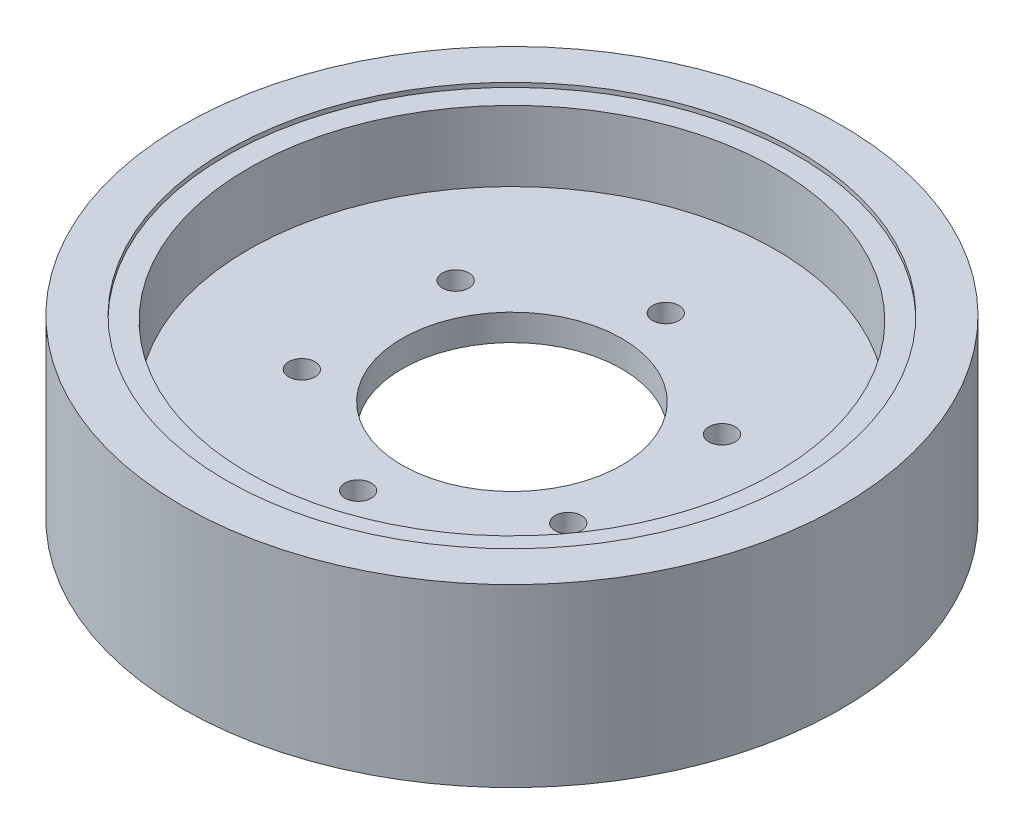
ISO-10303-21;
HEADER;
FILE_DESCRIPTION(('STEP AP214'),'2;1');
FILE_NAME('part.step','',(''),(''),'','','');
FILE_SCHEMA(('AUTOMOTIVE_DESIGN { 1 0 10303 214 1 1 1 1 }'));
ENDSEC;
DATA;
#1=APPLICATION_CONTEXT('core data for automotive mechanical design processes');
#2=APPLICATION_PROTOCOL_DEFINITION('international standard','automotive_design',2000,#1);
#3=PRODUCT_CONTEXT('',#1,'mechanical');
#4=PRODUCT('Part','Part','',(#3));
#5=PRODUCT_RELATED_PRODUCT_CATEGORY('part','',(#4));
#6=PRODUCT_DEFINITION_FORMATION('','',#4);
#7=PRODUCT_DEFINITION_CONTEXT('part definition',#1,'design');
#8=PRODUCT_DEFINITION('design','',#6,#7);
#9=PRODUCT_DEFINITION_SHAPE('','',#8);
#10=(LENGTH_UNIT() NAMED_UNIT(*) SI_UNIT(.MILLI.,.METRE.));
#11=(NAMED_UNIT(*) PLANE_ANGLE_UNIT() SI_UNIT($,.RADIAN.));
#12=(NAMED_UNIT(*) SI_UNIT($,.STERADIAN.) SOLID_ANGLE_UNIT());
#13=UNCERTAINTY_MEASURE_WITH_UNIT(LENGTH_MEASURE(1.E-05),#10,'distance_accuracy_value','');
#14=(GEOMETRIC_REPRESENTATION_CONTEXT(3) GLOBAL_UNCERTAINTY_ASSIGNED_CONTEXT((#13)) GLOBAL_UNIT_ASSIGNED_CONTEXT((#10,
#11,#12)) REPRESENTATION_CONTEXT('',''));
#15=CARTESIAN_POINT('',(0.,0.,0.));
#16=DIRECTION('',(0.,0.,1.));
#17=DIRECTION('',(1.,0.,0.));
#18=AXIS2_PLACEMENT_3D('',#15,#16,#17);
#19=CARTESIAN_POINT('',(0.,23.,0.));
#20=DIRECTION('',(0.,1.,0.));
#21=DIRECTION('',(0.,0.,1.));
#22=AXIS2_PLACEMENT_3D('',#19,#20,#21);
#23=CYLINDRICAL_SURFACE('',#22,60.);
#24=CARTESIAN_POINT('',(0.,23.,0.));
#25=DIRECTION('',(0.,1.,0.));
#26=DIRECTION('',(0.,0.,1.));
#27=AXIS2_PLACEMENT_3D('',#24,#25,#26);
#28=CIRCLE('',#27,60.);
#29=CARTESIAN_POINT('',(0.,23.,60.));
#30=VERTEX_POINT('',#29);
#31=EDGE_CURVE('E54',#30,#30,#28,.T.);
#32=ORIENTED_EDGE('',*,*,#31,.F.);
#33=EDGE_LOOP('',(#32));
#34=FACE_BOUND('',#33,.T.);
#35=CARTESIAN_POINT('',(0.,39.,0.));
#36=DIRECTION('',(0.,1.,0.));
#37=DIRECTION('',(0.,0.,1.));
#38=AXIS2_PLACEMENT_3D('',#35,#36,#37);
#39=CIRCLE('',#38,60.);
#40=CARTESIAN_POINT('',(0.,39.,60.));
#41=VERTEX_POINT('',#40);
#42=EDGE_CURVE('E43',#41,#41,#39,.F.);
#43=ORIENTED_EDGE('',*,*,#42,.F.);
#44=EDGE_LOOP('',(#43));
#45=FACE_BOUND('',#44,.T.);
#46=ADVANCED_FACE('F39',(#34,#45),#23,.F.);
#47=CARTESIAN_POINT('',(0.,17.,0.));
#48=DIRECTION('',(0.,-1.,0.));
#49=DIRECTION('',(0.,0.,-1.));
#50=AXIS2_PLACEMENT_3D('',#47,#48,#49);
#51=CYLINDRICAL_SURFACE('',#50,60.);
#52=CARTESIAN_POINT('',(0.,17.,0.));
#53=DIRECTION('',(0.,-1.,0.));
#54=DIRECTION('',(0.,0.,-1.));
#55=AXIS2_PLACEMENT_3D('',#52,#53,#54);
#56=CIRCLE('',#55,60.);
#57=CARTESIAN_POINT('',(0.,17.,-60.));
#58=VERTEX_POINT('',#57);
#59=EDGE_CURVE('E63',#58,#58,#56,.T.);
#60=ORIENTED_EDGE('',*,*,#59,.F.);
#61=EDGE_LOOP('',(#60));
#62=FACE_BOUND('',#61,.T.);
#63=CARTESIAN_POINT('',(0.,1.,0.));
#64=DIRECTION('',(0.,-1.,0.));
#65=DIRECTION('',(0.,0.,-1.));
#66=AXIS2_PLACEMENT_3D('',#63,#64,#65);
#67=CIRCLE('',#66,60.);
#68=CARTESIAN_POINT('',(0.,1.,-60.));
#69=VERTEX_POINT('',#68);
#70=EDGE_CURVE('E64',#69,#69,#67,.F.);
#71=ORIENTED_EDGE('',*,*,#70,.F.);
#72=EDGE_LOOP('',(#71));
#73=FACE_BOUND('',#72,.T.);
#74=ADVANCED_FACE('F145',(#62,#73),#51,.F.);
#75=CARTESIAN_POINT('',(0.,0.,0.));
#76=DIRECTION('',(0.,1.,0.));
#77=DIRECTION('',(0.,0.,1.));
#78=AXIS2_PLACEMENT_3D('',#75,#76,#77);
#79=CYLINDRICAL_SURFACE('',#78,25.);
#80=CARTESIAN_POINT('',(0.,23.,0.));
#81=DIRECTION('',(0.,1.,0.));
#82=DIRECTION('',(0.,0.,1.));
#83=AXIS2_PLACEMENT_3D('',#80,#81,#82);
#84=CIRCLE('',#83,25.);
#85=CARTESIAN_POINT('',(0.,23.,25.));
#86=VERTEX_POINT('',#85);
#87=EDGE_CURVE('E114',#86,#86,#84,.T.);
#88=ORIENTED_EDGE('',*,*,#87,.T.);
#89=EDGE_LOOP('',(#88));
#90=FACE_BOUND('',#89,.T.);
#91=CARTESIAN_POINT('',(0.,17.,0.));
#92=DIRECTION('',(0.,-1.,0.));
#93=DIRECTION('',(0.,0.,-1.));
#94=AXIS2_PLACEMENT_3D('',#91,#92,#93);
#95=CIRCLE('',#94,25.);
#96=CARTESIAN_POINT('',(0.,17.,-25.));
#97=VERTEX_POINT('',#96);
#98=EDGE_CURVE('E105',#97,#97,#95,.F.);
#99=ORIENTED_EDGE('',*,*,#98,.F.);
#100=EDGE_LOOP('',(#99));
#101=FACE_BOUND('',#100,.T.);
#102=ADVANCED_FACE('F178',(#90,#101),#79,.F.);
#103=CARTESIAN_POINT('',(30.3108891324568,0.,-17.5000000000026));
#104=DIRECTION('',(0.,1.,0.));
#105=DIRECTION('',(0.,0.,1.));
#106=AXIS2_PLACEMENT_3D('',#103,#104,#105);
#107=CYLINDRICAL_SURFACE('',#106,3.00000000000075);
#108=CARTESIAN_POINT('',(30.3108891324568,23.,-17.5000000000026));
#109=DIRECTION('',(0.,1.,0.));
#110=DIRECTION('',(0.,0.,1.));
#111=AXIS2_PLACEMENT_3D('',#108,#109,#110);
#112=CIRCLE('',#111,3.00000000000075);
#113=CARTESIAN_POINT('',(30.3108891324568,23.,-14.5000000000018));
#114=VERTEX_POINT('',#113);
#115=EDGE_CURVE('E115',#114,#114,#112,.T.);
#116=ORIENTED_EDGE('',*,*,#115,.T.);
#117=EDGE_LOOP('',(#116));
#118=FACE_BOUND('',#117,.T.);
#119=CARTESIAN_POINT('',(30.3108891324568,17.,-17.5000000000026));
#120=DIRECTION('',(0.,-1.,0.));
#121=DIRECTION('',(0.,0.,-1.));
#122=AXIS2_PLACEMENT_3D('',#119,#120,#121);
#123=CIRCLE('',#122,3.00000000000075);
#124=CARTESIAN_POINT('',(30.3108891324568,17.,-20.5000000000033));
#125=VERTEX_POINT('',#124);
#126=EDGE_CURVE('E101',#125,#125,#123,.F.);
#127=ORIENTED_EDGE('',*,*,#126,.F.);
#128=EDGE_LOOP('',(#127));
#129=FACE_BOUND('',#128,.T.);
#130=ADVANCED_FACE('F181',(#118,#129),#107,.F.);
#131=CARTESIAN_POINT('',(30.3108891324598,0.,17.4999999999974));
#132=DIRECTION('',(0.,1.,0.));
#133=DIRECTION('',(0.,0.,1.));
#134=AXIS2_PLACEMENT_3D('',#131,#132,#133);
#135=CYLINDRICAL_SURFACE('',#134,3.00000000000369);
#136=CARTESIAN_POINT('',(30.3108891324598,23.,17.4999999999974));
#137=DIRECTION('',(0.,1.,0.));
#138=DIRECTION('',(0.,0.,1.));
#139=AXIS2_PLACEMENT_3D('',#136,#137,#138);
#140=CIRCLE('',#139,3.00000000000369);
#141=CARTESIAN_POINT('',(30.3108891324598,23.,20.5000000000011));
#142=VERTEX_POINT('',#141);
#143=EDGE_CURVE('E123',#142,#142,#140,.T.);
#144=ORIENTED_EDGE('',*,*,#143,.T.);
#145=EDGE_LOOP('',(#144));
#146=FACE_BOUND('',#145,.T.);
#147=CARTESIAN_POINT('',(30.3108891324598,17.,17.4999999999974));
#148=DIRECTION('',(0.,-1.,0.));
#149=DIRECTION('',(0.,0.,-1.));
#150=AXIS2_PLACEMENT_3D('',#147,#148,#149);
#151=CIRCLE('',#150,3.00000000000369);
#152=CARTESIAN_POINT('',(30.3108891324598,17.,14.4999999999937));
#153=VERTEX_POINT('',#152);
#154=EDGE_CURVE('E97',#153,#153,#151,.F.);
#155=ORIENTED_EDGE('',*,*,#154,.F.);
#156=EDGE_LOOP('',(#155));
#157=FACE_BOUND('',#156,.T.);
#158=ADVANCED_FACE('F190',(#146,#157),#135,.F.);
#159=CARTESIAN_POINT('',(5.95998645279081E-12,0.,35.));
#160=DIRECTION('',(0.,1.,0.));
#161=DIRECTION('',(0.,0.,1.));
#162=AXIS2_PLACEMENT_3D('',#159,#160,#161);
#163=CYLINDRICAL_SURFACE('',#162,3.00000000000594);
#164=CARTESIAN_POINT('',(5.95998645279081E-12,23.,35.));
#165=DIRECTION('',(0.,1.,0.));
#166=DIRECTION('',(0.,0.,1.));
#167=AXIS2_PLACEMENT_3D('',#164,#165,#166);
#168=CIRCLE('',#167,3.00000000000594);
#169=CARTESIAN_POINT('',(5.95998645279081E-12,23.,38.0000000000059));
#170=VERTEX_POINT('',#169);
#171=EDGE_CURVE('E127',#170,#170,#168,.T.);
#172=ORIENTED_EDGE('',*,*,#171,.T.);
#173=EDGE_LOOP('',(#172));
#174=FACE_BOUND('',#173,.T.);
#175=CARTESIAN_POINT('',(5.95998645279081E-12,17.,35.));
#176=DIRECTION('',(0.,-1.,0.));
#177=DIRECTION('',(0.,0.,-1.));
#178=AXIS2_PLACEMENT_3D('',#175,#176,#177);
#179=CIRCLE('',#178,3.00000000000594);
#180=CARTESIAN_POINT('',(5.95998645279081E-12,17.,31.9999999999941));
#181=VERTEX_POINT('',#180);
#182=EDGE_CURVE('E93',#181,#181,#179,.F.);
#183=ORIENTED_EDGE('',*,*,#182,.F.);
#184=EDGE_LOOP('',(#183));
#185=FACE_BOUND('',#184,.T.);
#186=ADVANCED_FACE('F186',(#174,#185),#163,.F.);
#187=CARTESIAN_POINT('',(-30.3108891324509,0.,17.5000000000026));
#188=DIRECTION('',(0.,1.,0.));
#189=DIRECTION('',(0.,0.,1.));
#190=AXIS2_PLACEMENT_3D('',#187,#188,#189);
#191=CYLINDRICAL_SURFACE('',#190,3.00000000000535);
#192=CARTESIAN_POINT('',(-30.3108891324509,23.,17.5000000000026));
#193=DIRECTION('',(0.,1.,0.));
#194=DIRECTION('',(0.,0.,1.));
#195=AXIS2_PLACEMENT_3D('',#192,#193,#194);
#196=CIRCLE('',#195,3.00000000000535);
#197=CARTESIAN_POINT('',(-30.3108891324509,23.,20.5000000000079));
#198=VERTEX_POINT('',#197);
#199=EDGE_CURVE('E119',#198,#198,#196,.T.);
#200=ORIENTED_EDGE('',*,*,#199,.T.);
#201=EDGE_LOOP('',(#200));
#202=FACE_BOUND('',#201,.T.);
#203=CARTESIAN_POINT('',(-30.3108891324509,17.,17.5000000000026));
#204=DIRECTION('',(0.,-1.,0.));
#205=DIRECTION('',(0.,0.,-1.));
#206=AXIS2_PLACEMENT_3D('',#203,#204,#205);
#207=CIRCLE('',#206,3.00000000000535);
#208=CARTESIAN_POINT('',(-30.3108891324509,17.,14.4999999999972));
#209=VERTEX_POINT('',#208);
#210=EDGE_CURVE('E89',#209,#209,#207,.F.);
#211=ORIENTED_EDGE('',*,*,#210,.F.);
#212=EDGE_LOOP('',(#211));
#213=FACE_BOUND('',#212,.T.);
#214=ADVANCED_FACE('F182',(#202,#213),#191,.F.);
#215=CARTESIAN_POINT('',(-30.3108891324539,0.,-17.4999999999974));
#216=DIRECTION('',(0.,1.,0.));
#217=DIRECTION('',(0.,0.,1.));
#218=AXIS2_PLACEMENT_3D('',#215,#216,#217);
#219=CYLINDRICAL_SURFACE('',#218,3.00000000000259);
#220=CARTESIAN_POINT('',(-30.3108891324539,23.,-17.4999999999974));
#221=DIRECTION('',(0.,1.,0.));
#222=DIRECTION('',(0.,0.,1.));
#223=AXIS2_PLACEMENT_3D('',#220,#221,#222);
#224=CIRCLE('',#223,3.00000000000259);
#225=CARTESIAN_POINT('',(-30.3108891324539,23.,-14.4999999999948));
#226=VERTEX_POINT('',#225);
#227=EDGE_CURVE('E109',#226,#226,#224,.T.);
#228=ORIENTED_EDGE('',*,*,#227,.T.);
#229=EDGE_LOOP('',(#228));
#230=FACE_BOUND('',#229,.T.);
#231=CARTESIAN_POINT('',(-30.3108891324539,17.,-17.4999999999974));
#232=DIRECTION('',(0.,-1.,0.));
#233=DIRECTION('',(0.,0.,-1.));
#234=AXIS2_PLACEMENT_3D('',#231,#232,#233);
#235=CIRCLE('',#234,3.00000000000259);
#236=CARTESIAN_POINT('',(-30.3108891324539,17.,-20.5));
#237=VERTEX_POINT('',#236);
#238=EDGE_CURVE('E62',#237,#237,#235,.F.);
#239=ORIENTED_EDGE('',*,*,#238,.F.);
#240=EDGE_LOOP('',(#239));
#241=FACE_BOUND('',#240,.T.);
#242=ADVANCED_FACE('F185',(#230,#241),#219,.F.);
#243=CARTESIAN_POINT('',(0.,0.,-35.));
#244=DIRECTION('',(0.,1.,0.));
#245=DIRECTION('',(0.,0.,1.));
#246=AXIS2_PLACEMENT_3D('',#243,#244,#245);
#247=CYLINDRICAL_SURFACE('',#246,3.);
#248=CARTESIAN_POINT('',(0.,23.,-35.));
#249=DIRECTION('',(0.,1.,0.));
#250=DIRECTION('',(0.,0.,1.));
#251=AXIS2_PLACEMENT_3D('',#248,#249,#250);
#252=CIRCLE('',#251,3.);
#253=CARTESIAN_POINT('',(0.,23.,-32.));
#254=VERTEX_POINT('',#253);
#255=EDGE_CURVE('E110',#254,#254,#252,.T.);
#256=ORIENTED_EDGE('',*,*,#255,.T.);
#257=EDGE_LOOP('',(#256));
#258=FACE_BOUND('',#257,.T.);
#259=CARTESIAN_POINT('',(0.,17.,-35.));
#260=DIRECTION('',(0.,-1.,0.));
#261=DIRECTION('',(0.,0.,-1.));
#262=AXIS2_PLACEMENT_3D('',#259,#260,#261);
#263=CIRCLE('',#262,3.);
#264=CARTESIAN_POINT('',(0.,17.,-38.));
#265=VERTEX_POINT('',#264);
#266=EDGE_CURVE('E59',#265,#265,#263,.F.);
#267=ORIENTED_EDGE('',*,*,#266,.F.);
#268=EDGE_LOOP('',(#267));
#269=FACE_BOUND('',#268,.T.);
#270=ADVANCED_FACE('F171',(#258,#269),#247,.F.);
#271=CARTESIAN_POINT('',(0.,40.,0.));
#272=DIRECTION('',(0.,-1.,0.));
#273=DIRECTION('',(0.,0.,-1.));
#274=AXIS2_PLACEMENT_3D('',#271,#272,#273);
#275=CYLINDRICAL_SURFACE('',#274,75.);
#276=CARTESIAN_POINT('',(0.,40.,0.));
#277=DIRECTION('',(0.,1.,0.));
#278=DIRECTION('',(0.,0.,1.));
#279=AXIS2_PLACEMENT_3D('',#276,#277,#278);
#280=CIRCLE('',#279,75.);
#281=CARTESIAN_POINT('',(0.,40.,75.));
#282=VERTEX_POINT('',#281);
#283=EDGE_CURVE('E10',#282,#282,#280,.T.);
#284=ORIENTED_EDGE('',*,*,#283,.F.);
#285=EDGE_LOOP('',(#284));
#286=FACE_BOUND('',#285,.T.);
#287=CARTESIAN_POINT('',(0.,0.,0.));
#288=DIRECTION('',(0.,1.,0.));
#289=DIRECTION('',(0.,0.,1.));
#290=AXIS2_PLACEMENT_3D('',#287,#288,#289);
#291=CIRCLE('',#290,75.);
#292=CARTESIAN_POINT('',(0.,0.,75.));
#293=VERTEX_POINT('',#292);
#294=EDGE_CURVE('E48',#293,#293,#291,.T.);
#295=ORIENTED_EDGE('',*,*,#294,.T.);
#296=EDGE_LOOP('',(#295));
#297=FACE_BOUND('',#296,.T.);
#298=ADVANCED_FACE('F41',(#286,#297),#275,.T.);
#299=CARTESIAN_POINT('',(0.,40.,0.));
#300=DIRECTION('',(0.,1.,0.));
#301=DIRECTION('',(0.,0.,1.));
#302=AXIS2_PLACEMENT_3D('',#299,#300,#301);
#303=PLANE('',#302);
#304=CARTESIAN_POINT('',(0.,40.,0.));
#305=DIRECTION('',(0.,1.,0.));
#306=DIRECTION('',(0.,0.,1.));
#307=AXIS2_PLACEMENT_3D('',#304,#305,#306);
#308=CIRCLE('',#307,65.);
#309=CARTESIAN_POINT('',(0.,40.,65.));
#310=VERTEX_POINT('',#309);
#311=EDGE_CURVE('E83',#310,#310,#308,.T.);
#312=ORIENTED_EDGE('',*,*,#311,.F.);
#313=EDGE_LOOP('',(#312));
#314=FACE_BOUND('',#313,.T.);
#315=ORIENTED_EDGE('',*,*,#283,.T.);
#316=EDGE_LOOP('',(#315));
#317=FACE_BOUND('',#316,.T.);
#318=ADVANCED_FACE('F162',(#314,#317),#303,.T.);
#319=CARTESIAN_POINT('',(0.,0.,0.));
#320=DIRECTION('',(0.,1.,0.));
#321=DIRECTION('',(0.,0.,1.));
#322=AXIS2_PLACEMENT_3D('',#319,#320,#321);
#323=PLANE('',#322);
#324=CARTESIAN_POINT('',(0.,0.,0.));
#325=DIRECTION('',(0.,-1.,0.));
#326=DIRECTION('',(0.,0.,-1.));
#327=AXIS2_PLACEMENT_3D('',#324,#325,#326);
#328=CIRCLE('',#327,65.);
#329=CARTESIAN_POINT('',(0.,0.,-65.));
#330=VERTEX_POINT('',#329);
#331=EDGE_CURVE('E75',#330,#330,#328,.T.);
#332=ORIENTED_EDGE('',*,*,#331,.F.);
#333=EDGE_LOOP('',(#332));
#334=FACE_BOUND('',#333,.T.);
#335=ORIENTED_EDGE('',*,*,#294,.F.);
#336=EDGE_LOOP('',(#335));
#337=FACE_BOUND('',#336,.T.);
#338=ADVANCED_FACE('F164',(#334,#337),#323,.F.);
#339=CARTESIAN_POINT('',(0.,23.,0.));
#340=DIRECTION('',(0.,1.,0.));
#341=DIRECTION('',(0.,0.,1.));
#342=AXIS2_PLACEMENT_3D('',#339,#340,#341);
#343=PLANE('',#342);
#344=ORIENTED_EDGE('',*,*,#255,.F.);
#345=EDGE_LOOP('',(#344));
#346=FACE_BOUND('',#345,.T.);
#347=ORIENTED_EDGE('',*,*,#227,.F.);
#348=EDGE_LOOP('',(#347));
#349=FACE_BOUND('',#348,.T.);
#350=ORIENTED_EDGE('',*,*,#199,.F.);
#351=EDGE_LOOP('',(#350));
#352=FACE_BOUND('',#351,.T.);
#353=ORIENTED_EDGE('',*,*,#171,.F.);
#354=EDGE_LOOP('',(#353));
#355=FACE_BOUND('',#354,.T.);
#356=ORIENTED_EDGE('',*,*,#143,.F.);
#357=EDGE_LOOP('',(#356));
#358=FACE_BOUND('',#357,.T.);
#359=ORIENTED_EDGE('',*,*,#115,.F.);
#360=EDGE_LOOP('',(#359));
#361=FACE_BOUND('',#360,.T.);
#362=ORIENTED_EDGE('',*,*,#87,.F.);
#363=EDGE_LOOP('',(#362));
#364=FACE_BOUND('',#363,.T.);
#365=ORIENTED_EDGE('',*,*,#31,.T.);
#366=EDGE_LOOP('',(#365));
#367=FACE_BOUND('',#366,.T.);
#368=ADVANCED_FACE('F141',(#346,#349,#352,#355,#358,#361,#364,#367),#343,.T.);
#369=CARTESIAN_POINT('',(0.,17.,0.));
#370=DIRECTION('',(0.,-1.,0.));
#371=DIRECTION('',(0.,0.,-1.));
#372=AXIS2_PLACEMENT_3D('',#369,#370,#371);
#373=PLANE('',#372);
#374=ORIENTED_EDGE('',*,*,#59,.T.);
#375=EDGE_LOOP('',(#374));
#376=FACE_BOUND('',#375,.T.);
#377=ORIENTED_EDGE('',*,*,#266,.T.);
#378=EDGE_LOOP('',(#377));
#379=FACE_BOUND('',#378,.T.);
#380=ORIENTED_EDGE('',*,*,#238,.T.);
#381=EDGE_LOOP('',(#380));
#382=FACE_BOUND('',#381,.T.);
#383=ORIENTED_EDGE('',*,*,#210,.T.);
#384=EDGE_LOOP('',(#383));
#385=FACE_BOUND('',#384,.T.);
#386=ORIENTED_EDGE('',*,*,#182,.T.);
#387=EDGE_LOOP('',(#386));
#388=FACE_BOUND('',#387,.T.);
#389=ORIENTED_EDGE('',*,*,#154,.T.);
#390=EDGE_LOOP('',(#389));
#391=FACE_BOUND('',#390,.T.);
#392=ORIENTED_EDGE('',*,*,#126,.T.);
#393=EDGE_LOOP('',(#392));
#394=FACE_BOUND('',#393,.T.);
#395=ORIENTED_EDGE('',*,*,#98,.T.);
#396=EDGE_LOOP('',(#395));
#397=FACE_BOUND('',#396,.T.);
#398=ADVANCED_FACE('F176',(#376,#379,#382,#385,#388,#391,#394,#397),#373,.T.);
#399=CARTESIAN_POINT('',(0.,1.,0.));
#400=DIRECTION('',(0.,-1.,0.));
#401=DIRECTION('',(0.,0.,-1.));
#402=AXIS2_PLACEMENT_3D('',#399,#400,#401);
#403=PLANE('',#402);
#404=CARTESIAN_POINT('',(0.,1.,0.));
#405=DIRECTION('',(0.,-1.,0.));
#406=DIRECTION('',(0.,0.,-1.));
#407=AXIS2_PLACEMENT_3D('',#404,#405,#406);
#408=CIRCLE('',#407,65.);
#409=CARTESIAN_POINT('',(0.,1.,-65.));
#410=VERTEX_POINT('',#409);
#411=EDGE_CURVE('E67',#410,#410,#408,.T.);
#412=ORIENTED_EDGE('',*,*,#411,.T.);
#413=EDGE_LOOP('',(#412));
#414=FACE_BOUND('',#413,.T.);
#415=ORIENTED_EDGE('',*,*,#70,.T.);
#416=EDGE_LOOP('',(#415));
#417=FACE_BOUND('',#416,.T.);
#418=ADVANCED_FACE('F209',(#414,#417),#403,.T.);
#419=CARTESIAN_POINT('',(0.,1.,0.));
#420=DIRECTION('',(0.,-1.,0.));
#421=DIRECTION('',(0.,0.,-1.));
#422=AXIS2_PLACEMENT_3D('',#419,#420,#421);
#423=CYLINDRICAL_SURFACE('',#422,65.);
#424=ORIENTED_EDGE('',*,*,#411,.F.);
#425=EDGE_LOOP('',(#424));
#426=FACE_BOUND('',#425,.T.);
#427=ORIENTED_EDGE('',*,*,#331,.T.);
#428=EDGE_LOOP('',(#427));
#429=FACE_BOUND('',#428,.T.);
#430=ADVANCED_FACE('F211',(#426,#429),#423,.F.);
#431=CARTESIAN_POINT('',(0.,39.,0.));
#432=DIRECTION('',(0.,1.,0.));
#433=DIRECTION('',(0.,0.,1.));
#434=AXIS2_PLACEMENT_3D('',#431,#432,#433);
#435=PLANE('',#434);
#436=CARTESIAN_POINT('',(0.,39.,0.));
#437=DIRECTION('',(0.,1.,0.));
#438=DIRECTION('',(0.,0.,1.));
#439=AXIS2_PLACEMENT_3D('',#436,#437,#438);
#440=CIRCLE('',#439,65.);
#441=CARTESIAN_POINT('',(0.,39.,65.));
#442=VERTEX_POINT('',#441);
#443=EDGE_CURVE('E151',#442,#442,#440,.T.);
#444=ORIENTED_EDGE('',*,*,#443,.T.);
#445=EDGE_LOOP('',(#444));
#446=FACE_BOUND('',#445,.T.);
#447=ORIENTED_EDGE('',*,*,#42,.T.);
#448=EDGE_LOOP('',(#447));
#449=FACE_BOUND('',#448,.T.);
#450=ADVANCED_FACE('F214',(#446,#449),#435,.T.);
#451=CARTESIAN_POINT('',(0.,39.,0.));
#452=DIRECTION('',(0.,1.,0.));
#453=DIRECTION('',(0.,0.,1.));
#454=AXIS2_PLACEMENT_3D('',#451,#452,#453);
#455=CYLINDRICAL_SURFACE('',#454,65.);
#456=ORIENTED_EDGE('',*,*,#443,.F.);
#457=EDGE_LOOP('',(#456));
#458=FACE_BOUND('',#457,.T.);
#459=ORIENTED_EDGE('',*,*,#311,.T.);
#460=EDGE_LOOP('',(#459));
#461=FACE_BOUND('',#460,.T.);
#462=ADVANCED_FACE('F160',(#458,#461),#455,.F.);
#463=CLOSED_SHELL('',(#46,#74,#102,#130,#158,#186,#214,#242,#270,#298,#318,#338,#368,#398,#418,
#430,#450,#462));
#464=MANIFOLD_SOLID_BREP('B2',#463);
#465=ADVANCED_BREP_SHAPE_REPRESENTATION('',(#18,#464),#14);
#466=SHAPE_DEFINITION_REPRESENTATION(#9,#465);
ENDSEC;
END-ISO-10303-21;
